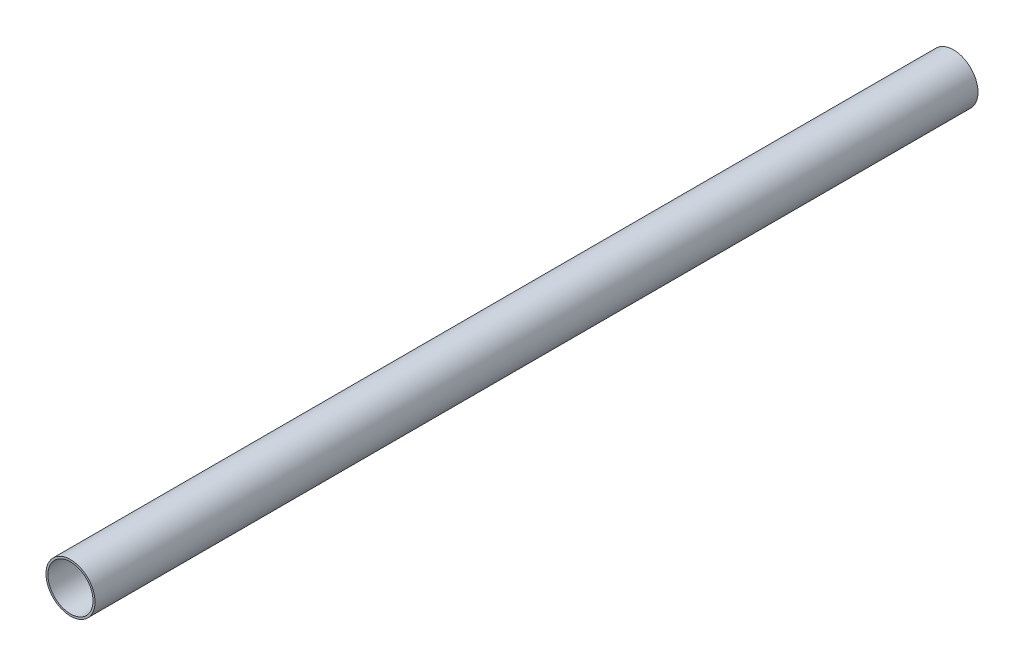
ISO-10303-21;
HEADER;
FILE_DESCRIPTION(('STEP AP214'),'2;1');
FILE_NAME('part.step','',(''),(''),'','','');
FILE_SCHEMA(('AUTOMOTIVE_DESIGN { 1 0 10303 214 1 1 1 1 }'));
ENDSEC;
DATA;
#1=APPLICATION_CONTEXT('core data for automotive mechanical design processes');
#2=APPLICATION_PROTOCOL_DEFINITION('international standard','automotive_design',2000,#1);
#3=PRODUCT_CONTEXT('',#1,'mechanical');
#4=PRODUCT('Part','Part','',(#3));
#5=PRODUCT_RELATED_PRODUCT_CATEGORY('part','',(#4));
#6=PRODUCT_DEFINITION_FORMATION('','',#4);
#7=PRODUCT_DEFINITION_CONTEXT('part definition',#1,'design');
#8=PRODUCT_DEFINITION('design','',#6,#7);
#9=PRODUCT_DEFINITION_SHAPE('','',#8);
#10=(LENGTH_UNIT() NAMED_UNIT(*) SI_UNIT(.MILLI.,.METRE.));
#11=(NAMED_UNIT(*) PLANE_ANGLE_UNIT() SI_UNIT($,.RADIAN.));
#12=(NAMED_UNIT(*) SI_UNIT($,.STERADIAN.) SOLID_ANGLE_UNIT());
#13=UNCERTAINTY_MEASURE_WITH_UNIT(LENGTH_MEASURE(1.E-05),#10,'distance_accuracy_value','');
#14=(GEOMETRIC_REPRESENTATION_CONTEXT(3) GLOBAL_UNCERTAINTY_ASSIGNED_CONTEXT((#13)) GLOBAL_UNIT_ASSIGNED_CONTEXT((#10,
#11,#12)) REPRESENTATION_CONTEXT('',''));
#15=CARTESIAN_POINT('',(0.,0.,0.));
#16=DIRECTION('',(0.,0.,1.));
#17=DIRECTION('',(1.,0.,0.));
#18=AXIS2_PLACEMENT_3D('',#15,#16,#17);
#19=CARTESIAN_POINT('',(0.,0.,1800.));
#20=DIRECTION('',(0.,0.,1.));
#21=DIRECTION('',(1.,0.,0.));
#22=AXIS2_PLACEMENT_3D('',#19,#20,#21);
#23=PLANE('',#22);
#24=CARTESIAN_POINT('',(0.,0.,1800.));
#25=DIRECTION('',(0.,0.,1.));
#26=DIRECTION('',(1.,0.,0.));
#27=AXIS2_PLACEMENT_3D('',#24,#25,#26);
#28=CIRCLE('',#27,50.);
#29=CARTESIAN_POINT('',(50.,0.,1800.));
#30=VERTEX_POINT('',#29);
#31=EDGE_CURVE('E10',#30,#30,#28,.T.);
#32=ORIENTED_EDGE('',*,*,#31,.T.);
#33=EDGE_LOOP('',(#32));
#34=FACE_BOUND('',#33,.T.);
#35=CARTESIAN_POINT('',(0.,0.,1800.));
#36=DIRECTION('',(0.,0.,1.));
#37=DIRECTION('',(1.,0.,0.));
#38=AXIS2_PLACEMENT_3D('',#35,#36,#37);
#39=CIRCLE('',#38,46.);
#40=CARTESIAN_POINT('',(46.,0.,1800.));
#41=VERTEX_POINT('',#40);
#42=EDGE_CURVE('E50',#41,#41,#39,.T.);
#43=ORIENTED_EDGE('',*,*,#42,.F.);
#44=EDGE_LOOP('',(#43));
#45=FACE_BOUND('',#44,.T.);
#46=ADVANCED_FACE('F39',(#34,#45),#23,.T.);
#47=CARTESIAN_POINT('',(0.,0.,0.));
#48=DIRECTION('',(0.,0.,1.));
#49=DIRECTION('',(1.,0.,0.));
#50=AXIS2_PLACEMENT_3D('',#47,#48,#49);
#51=PLANE('',#50);
#52=CARTESIAN_POINT('',(0.,0.,0.));
#53=DIRECTION('',(0.,0.,1.));
#54=DIRECTION('',(1.,0.,0.));
#55=AXIS2_PLACEMENT_3D('',#52,#53,#54);
#56=CIRCLE('',#55,50.);
#57=CARTESIAN_POINT('',(50.,0.,0.));
#58=VERTEX_POINT('',#57);
#59=EDGE_CURVE('E43',#58,#58,#56,.T.);
#60=ORIENTED_EDGE('',*,*,#59,.F.);
#61=EDGE_LOOP('',(#60));
#62=FACE_BOUND('',#61,.T.);
#63=CARTESIAN_POINT('',(0.,0.,0.));
#64=DIRECTION('',(0.,0.,1.));
#65=DIRECTION('',(1.,0.,0.));
#66=AXIS2_PLACEMENT_3D('',#63,#64,#65);
#67=CIRCLE('',#66,46.);
#68=CARTESIAN_POINT('',(46.,0.,0.));
#69=VERTEX_POINT('',#68);
#70=EDGE_CURVE('E52',#69,#69,#67,.T.);
#71=ORIENTED_EDGE('',*,*,#70,.T.);
#72=EDGE_LOOP('',(#71));
#73=FACE_BOUND('',#72,.T.);
#74=ADVANCED_FACE('F62',(#62,#73),#51,.F.);
#75=CARTESIAN_POINT('',(0.,0.,1800.));
#76=DIRECTION('',(0.,0.,-1.));
#77=DIRECTION('',(-1.,0.,0.));
#78=AXIS2_PLACEMENT_3D('',#75,#76,#77);
#79=CYLINDRICAL_SURFACE('',#78,50.);
#80=ORIENTED_EDGE('',*,*,#31,.F.);
#81=EDGE_LOOP('',(#80));
#82=FACE_BOUND('',#81,.T.);
#83=ORIENTED_EDGE('',*,*,#59,.T.);
#84=EDGE_LOOP('',(#83));
#85=FACE_BOUND('',#84,.T.);
#86=ADVANCED_FACE('F41',(#82,#85),#79,.T.);
#87=CARTESIAN_POINT('',(0.,0.,1800.));
#88=DIRECTION('',(0.,0.,-1.));
#89=DIRECTION('',(-1.,0.,0.));
#90=AXIS2_PLACEMENT_3D('',#87,#88,#89);
#91=CYLINDRICAL_SURFACE('',#90,46.);
#92=ORIENTED_EDGE('',*,*,#42,.T.);
#93=EDGE_LOOP('',(#92));
#94=FACE_BOUND('',#93,.T.);
#95=ORIENTED_EDGE('',*,*,#70,.F.);
#96=EDGE_LOOP('',(#95));
#97=FACE_BOUND('',#96,.T.);
#98=ADVANCED_FACE('F58',(#94,#97),#91,.F.);
#99=CLOSED_SHELL('',(#46,#74,#86,#98));
#100=MANIFOLD_SOLID_BREP('B2',#99);
#101=ADVANCED_BREP_SHAPE_REPRESENTATION('',(#18,#100),#14);
#102=SHAPE_DEFINITION_REPRESENTATION(#9,#101);
ENDSEC;
END-ISO-10303-21;
